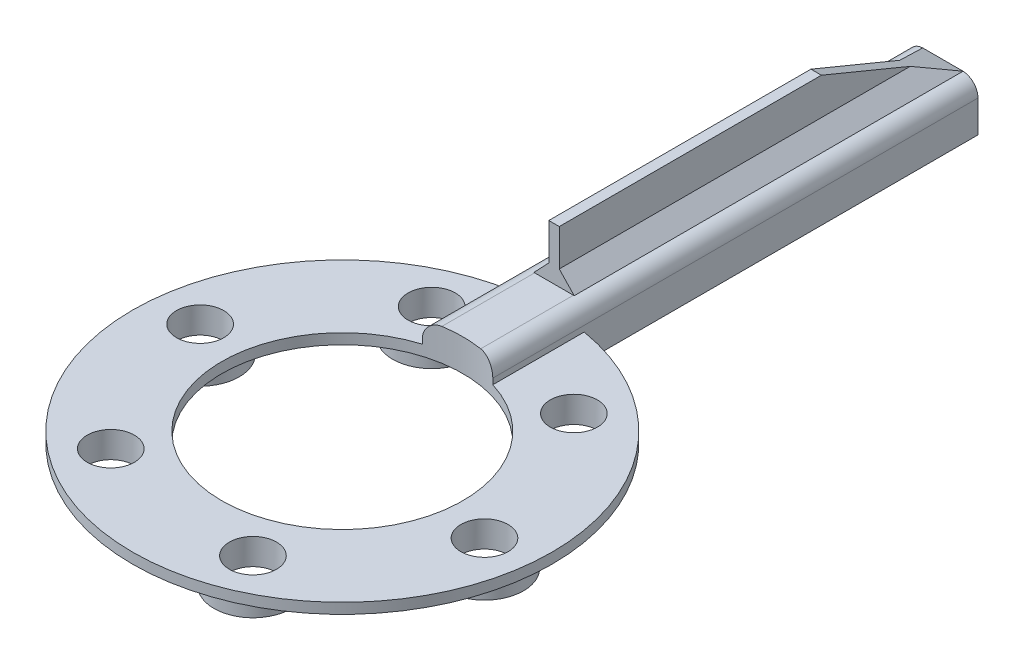
ISO-10303-21;
HEADER;
FILE_DESCRIPTION(('STEP AP214'),'2;1');
FILE_NAME('part.step','',(''),(''),'','','');
FILE_SCHEMA(('AUTOMOTIVE_DESIGN { 1 0 10303 214 1 1 1 1 }'));
ENDSEC;
DATA;
#1=APPLICATION_CONTEXT('core data for automotive mechanical design processes');
#2=APPLICATION_PROTOCOL_DEFINITION('international standard','automotive_design',2000,#1);
#3=PRODUCT_CONTEXT('',#1,'mechanical');
#4=PRODUCT('Part','Part','',(#3));
#5=PRODUCT_RELATED_PRODUCT_CATEGORY('part','',(#4));
#6=PRODUCT_DEFINITION_FORMATION('','',#4);
#7=PRODUCT_DEFINITION_CONTEXT('part definition',#1,'design');
#8=PRODUCT_DEFINITION('design','',#6,#7);
#9=PRODUCT_DEFINITION_SHAPE('','',#8);
#10=(LENGTH_UNIT() NAMED_UNIT(*) SI_UNIT(.MILLI.,.METRE.));
#11=(NAMED_UNIT(*) PLANE_ANGLE_UNIT() SI_UNIT($,.RADIAN.));
#12=(NAMED_UNIT(*) SI_UNIT($,.STERADIAN.) SOLID_ANGLE_UNIT());
#13=UNCERTAINTY_MEASURE_WITH_UNIT(LENGTH_MEASURE(1.E-05),#10,'distance_accuracy_value','');
#14=(GEOMETRIC_REPRESENTATION_CONTEXT(3) GLOBAL_UNCERTAINTY_ASSIGNED_CONTEXT((#13)) GLOBAL_UNIT_ASSIGNED_CONTEXT((#10,
#11,#12)) REPRESENTATION_CONTEXT('',''));
#15=CARTESIAN_POINT('',(0.,0.,0.));
#16=DIRECTION('',(0.,0.,1.));
#17=DIRECTION('',(1.,0.,0.));
#18=AXIS2_PLACEMENT_3D('',#15,#16,#17);
#19=CARTESIAN_POINT('',(0.,0.,0.));
#20=DIRECTION('',(0.,1.,0.));
#21=DIRECTION('',(0.,0.,1.));
#22=AXIS2_PLACEMENT_3D('',#19,#20,#21);
#23=PLANE('',#22);
#24=CARTESIAN_POINT('',(0.,0.,0.));
#25=DIRECTION('',(0.,1.,0.));
#26=DIRECTION('',(0.,0.,1.));
#27=AXIS2_PLACEMENT_3D('',#24,#25,#26);
#28=CIRCLE('',#27,23.);
#29=CARTESIAN_POINT('',(0.,0.,23.));
#30=VERTEX_POINT('',#29);
#31=EDGE_CURVE('E277',#30,#30,#28,.T.);
#32=ORIENTED_EDGE('',*,*,#31,.T.);
#33=EDGE_LOOP('',(#32));
#34=FACE_BOUND('',#33,.T.);
#35=CARTESIAN_POINT('',(-19.1759850137748,0.,24.9906302191738));
#36=DIRECTION('',(0.,1.,0.));
#37=DIRECTION('',(0.,0.,1.));
#38=AXIS2_PLACEMENT_3D('',#35,#36,#37);
#39=CIRCLE('',#38,7.44688392869642);
#40=CARTESIAN_POINT('',(-19.1759850137748,0.,32.4375141478702));
#41=VERTEX_POINT('',#40);
#42=EDGE_CURVE('E287',#41,#41,#39,.F.);
#43=ORIENTED_EDGE('',*,*,#42,.F.);
#44=EDGE_LOOP('',(#43));
#45=FACE_BOUND('',#44,.T.);
#46=CARTESIAN_POINT('',(12.0545281194995,0.,29.1022052741037));
#47=DIRECTION('',(0.,1.,0.));
#48=DIRECTION('',(0.,0.,1.));
#49=AXIS2_PLACEMENT_3D('',#46,#47,#48);
#50=CIRCLE('',#49,7.44688392869571);
#51=CARTESIAN_POINT('',(12.0545281194995,0.,36.5490892027994));
#52=VERTEX_POINT('',#51);
#53=EDGE_CURVE('E292',#52,#52,#50,.F.);
#54=ORIENTED_EDGE('',*,*,#53,.F.);
#55=EDGE_LOOP('',(#54));
#56=FACE_BOUND('',#55,.T.);
#57=CARTESIAN_POINT('',(31.2305131332723,0.,4.11157505492955));
#58=DIRECTION('',(0.,1.,0.));
#59=DIRECTION('',(0.,0.,1.));
#60=AXIS2_PLACEMENT_3D('',#57,#58,#59);
#61=CIRCLE('',#60,7.44688392869377);
#62=CARTESIAN_POINT('',(31.2305131332723,0.,11.5584589836233));
#63=VERTEX_POINT('',#62);
#64=EDGE_CURVE('E295',#63,#63,#61,.F.);
#65=ORIENTED_EDGE('',*,*,#64,.F.);
#66=EDGE_LOOP('',(#65));
#67=FACE_BOUND('',#66,.T.);
#68=CARTESIAN_POINT('',(19.1759850137709,0.,-24.9906302191745));
#69=DIRECTION('',(0.,1.,0.));
#70=DIRECTION('',(0.,0.,1.));
#71=AXIS2_PLACEMENT_3D('',#68,#69,#70);
#72=CIRCLE('',#71,7.44688392869261);
#73=CARTESIAN_POINT('',(19.1759850137709,0.,-17.5437462904819));
#74=VERTEX_POINT('',#73);
#75=EDGE_CURVE('E298',#74,#74,#72,.F.);
#76=ORIENTED_EDGE('',*,*,#75,.F.);
#77=EDGE_LOOP('',(#76));
#78=FACE_BOUND('',#77,.T.);
#79=CARTESIAN_POINT('',(-31.2305131332763,0.,-4.11157505493029));
#80=DIRECTION('',(0.,1.,0.));
#81=DIRECTION('',(0.,0.,1.));
#82=AXIS2_PLACEMENT_3D('',#79,#80,#81);
#83=CIRCLE('',#82,7.44688392869558);
#84=CARTESIAN_POINT('',(-31.2305131332763,0.,3.33530887376529));
#85=VERTEX_POINT('',#84);
#86=EDGE_CURVE('E304',#85,#85,#83,.F.);
#87=ORIENTED_EDGE('',*,*,#86,.F.);
#88=EDGE_LOOP('',(#87));
#89=FACE_BOUND('',#88,.T.);
#90=CARTESIAN_POINT('',(-12.0545281195034,0.,-29.1022052741044));
#91=DIRECTION('',(0.,1.,0.));
#92=DIRECTION('',(0.,0.,1.));
#93=AXIS2_PLACEMENT_3D('',#90,#91,#92);
#94=CIRCLE('',#93,7.44688392869349);
#95=CARTESIAN_POINT('',(-12.0545281195034,0.,-21.6553213454109));
#96=VERTEX_POINT('',#95);
#97=EDGE_CURVE('E301',#96,#96,#94,.F.);
#98=ORIENTED_EDGE('',*,*,#97,.F.);
#99=EDGE_LOOP('',(#98));
#100=FACE_BOUND('',#99,.T.);
#101=DIRECTION('',(-1.,0.,0.));
#102=VECTOR('',#101,1.);
#103=CARTESIAN_POINT('',(-6.7,0.,-39.4348830352012));
#104=LINE('',#103,#102);
#105=CARTESIAN_POINT('',(6.7,0.,-39.4348830352012));
#106=VERTEX_POINT('',#105);
#107=CARTESIAN_POINT('',(-6.7,0.,-39.4348830352012));
#108=VERTEX_POINT('',#107);
#109=EDGE_CURVE('E160',#106,#108,#104,.T.);
#110=ORIENTED_EDGE('',*,*,#109,.F.);
#111=CARTESIAN_POINT('',(0.,0.,0.));
#112=DIRECTION('',(0.,1.,0.));
#113=DIRECTION('',(0.,0.,1.));
#114=AXIS2_PLACEMENT_3D('',#111,#112,#113);
#115=CIRCLE('',#114,40.);
#116=EDGE_CURVE('E281',#108,#106,#115,.T.);
#117=ORIENTED_EDGE('',*,*,#116,.F.);
#118=EDGE_LOOP('',(#110,#117));
#119=FACE_BOUND('',#118,.T.);
#120=ADVANCED_FACE('F35',(#34,#45,#56,#67,#78,#89,#100,#119),#23,.F.);
#121=CARTESIAN_POINT('',(0.,6.1,0.));
#122=DIRECTION('',(0.,-1.,0.));
#123=DIRECTION('',(0.,0.,-1.));
#124=AXIS2_PLACEMENT_3D('',#121,#122,#123);
#125=PLANE('',#124);
#126=DIRECTION('',(-1.,0.,0.));
#127=VECTOR('',#126,1.);
#128=CARTESIAN_POINT('',(1.,6.1,-40.3829480565997));
#129=LINE('',#128,#127);
#130=CARTESIAN_POINT('',(3.7,6.1,-40.3829480565997));
#131=VERTEX_POINT('',#130);
#132=CARTESIAN_POINT('',(-3.7,6.1,-40.3829480565997));
#133=VERTEX_POINT('',#132);
#134=EDGE_CURVE('E59',#131,#133,#129,.T.);
#135=ORIENTED_EDGE('',*,*,#134,.T.);
#136=DIRECTION('',(0.,0.,-1.));
#137=VECTOR('',#136,1.);
#138=CARTESIAN_POINT('',(-3.7,6.1,-22.0024998579707));
#139=LINE('',#138,#137);
#140=CARTESIAN_POINT('',(-3.7,6.1,-22.7004405243599));
#141=VERTEX_POINT('',#140);
#142=EDGE_CURVE('E398',#133,#141,#139,.F.);
#143=ORIENTED_EDGE('',*,*,#142,.T.);
#144=CARTESIAN_POINT('',(0.,6.1,0.));
#145=DIRECTION('',(0.,1.,0.));
#146=DIRECTION('',(0.,0.,-1.));
#147=AXIS2_PLACEMENT_3D('',#144,#145,#146);
#148=CIRCLE('',#147,23.);
#149=CARTESIAN_POINT('',(3.7,6.1,-22.7004405243599));
#150=VERTEX_POINT('',#149);
#151=EDGE_CURVE('E221',#150,#141,#148,.T.);
#152=ORIENTED_EDGE('',*,*,#151,.F.);
#153=DIRECTION('',(0.,0.,1.));
#154=VECTOR('',#153,1.);
#155=CARTESIAN_POINT('',(3.7,6.1,-114.555494514846));
#156=LINE('',#155,#154);
#157=EDGE_CURVE('E396',#150,#131,#156,.F.);
#158=ORIENTED_EDGE('',*,*,#157,.T.);
#159=EDGE_LOOP('',(#135,#143,#152,#158));
#160=FACE_BOUND('',#159,.T.);
#161=ADVANCED_FACE('F354',(#160),#125,.F.);
#162=CARTESIAN_POINT('',(0.,2.,0.));
#163=DIRECTION('',(0.,1.,0.));
#164=DIRECTION('',(0.,0.,1.));
#165=AXIS2_PLACEMENT_3D('',#162,#163,#164);
#166=PLANE('',#165);
#167=CARTESIAN_POINT('',(31.2305131332737,2.,4.11157505492763));
#168=DIRECTION('',(0.,1.,0.));
#169=DIRECTION('',(0.,0.,1.));
#170=AXIS2_PLACEMENT_3D('',#167,#168,#169);
#171=CIRCLE('',#170,4.4999999999962);
#172=CARTESIAN_POINT('',(31.2305131332737,2.,8.61157505492383));
#173=VERTEX_POINT('',#172);
#174=EDGE_CURVE('E190',#173,#173,#171,.T.);
#175=ORIENTED_EDGE('',*,*,#174,.F.);
#176=EDGE_LOOP('',(#175));
#177=FACE_BOUND('',#176,.T.);
#178=CARTESIAN_POINT('',(12.054528119503,2.,29.1022052741024));
#179=DIRECTION('',(0.,1.,0.));
#180=DIRECTION('',(0.,0.,1.));
#181=AXIS2_PLACEMENT_3D('',#178,#179,#180);
#182=CIRCLE('',#181,4.4999999999962);
#183=CARTESIAN_POINT('',(12.054528119503,2.,33.6022052740986));
#184=VERTEX_POINT('',#183);
#185=EDGE_CURVE('E193',#184,#184,#182,.T.);
#186=ORIENTED_EDGE('',*,*,#185,.F.);
#187=EDGE_LOOP('',(#186));
#188=FACE_BOUND('',#187,.T.);
#189=CARTESIAN_POINT('',(-19.1759850137707,2.,24.9906302191746));
#190=DIRECTION('',(0.,1.,0.));
#191=DIRECTION('',(0.,0.,1.));
#192=AXIS2_PLACEMENT_3D('',#189,#190,#191);
#193=CIRCLE('',#192,4.4999999999962);
#194=CARTESIAN_POINT('',(-19.1759850137707,2.,29.4906302191708));
#195=VERTEX_POINT('',#194);
#196=EDGE_CURVE('E196',#195,#195,#193,.T.);
#197=ORIENTED_EDGE('',*,*,#196,.F.);
#198=EDGE_LOOP('',(#197));
#199=FACE_BOUND('',#198,.T.);
#200=CARTESIAN_POINT('',(-31.2305131332737,2.,-4.11157505492787));
#201=DIRECTION('',(0.,1.,0.));
#202=DIRECTION('',(0.,0.,1.));
#203=AXIS2_PLACEMENT_3D('',#200,#201,#202);
#204=CIRCLE('',#203,4.4999999999962);
#205=CARTESIAN_POINT('',(-31.2305131332737,2.,0.388424945068334));
#206=VERTEX_POINT('',#205);
#207=EDGE_CURVE('E175',#206,#206,#204,.T.);
#208=ORIENTED_EDGE('',*,*,#207,.F.);
#209=EDGE_LOOP('',(#208));
#210=FACE_BOUND('',#209,.T.);
#211=CARTESIAN_POINT('',(-12.0545281195028,2.,-29.1022052741025));
#212=DIRECTION('',(0.,1.,0.));
#213=DIRECTION('',(0.,0.,1.));
#214=AXIS2_PLACEMENT_3D('',#211,#212,#213);
#215=CIRCLE('',#214,4.49999999999619);
#216=CARTESIAN_POINT('',(-12.0545281195028,2.,-24.6022052741063));
#217=VERTEX_POINT('',#216);
#218=EDGE_CURVE('E178',#217,#217,#215,.T.);
#219=ORIENTED_EDGE('',*,*,#218,.F.);
#220=EDGE_LOOP('',(#219));
#221=FACE_BOUND('',#220,.T.);
#222=CARTESIAN_POINT('',(19.1759850137709,2.,-24.9906302191745));
#223=DIRECTION('',(0.,1.,0.));
#224=DIRECTION('',(0.,0.,1.));
#225=AXIS2_PLACEMENT_3D('',#222,#223,#224);
#226=CIRCLE('',#225,4.4999999999962);
#227=CARTESIAN_POINT('',(19.1759850137709,2.,-20.4906302191783));
#228=VERTEX_POINT('',#227);
#229=EDGE_CURVE('E187',#228,#228,#226,.T.);
#230=ORIENTED_EDGE('',*,*,#229,.F.);
#231=EDGE_LOOP('',(#230));
#232=FACE_BOUND('',#231,.T.);
#233=DIRECTION('',(0.,0.,-1.));
#234=VECTOR('',#233,1.);
#235=CARTESIAN_POINT('',(6.7,2.,0.));
#236=LINE('',#235,#234);
#237=CARTESIAN_POINT('',(6.7,2.,-22.0024998579707));
#238=VERTEX_POINT('',#237);
#239=CARTESIAN_POINT('',(6.7,2.,-39.4348830352012));
#240=VERTEX_POINT('',#239);
#241=EDGE_CURVE('E239',#238,#240,#236,.T.);
#242=ORIENTED_EDGE('',*,*,#241,.F.);
#243=CARTESIAN_POINT('',(0.,2.,0.));
#244=DIRECTION('',(0.,1.,0.));
#245=DIRECTION('',(0.,0.,1.));
#246=AXIS2_PLACEMENT_3D('',#243,#244,#245);
#247=CIRCLE('',#246,23.);
#248=CARTESIAN_POINT('',(-6.7,2.,-22.0024998579707));
#249=VERTEX_POINT('',#248);
#250=EDGE_CURVE('E278',#249,#238,#247,.T.);
#251=ORIENTED_EDGE('',*,*,#250,.F.);
#252=DIRECTION('',(0.,0.,1.));
#253=VECTOR('',#252,1.);
#254=CARTESIAN_POINT('',(-6.7,2.,0.));
#255=LINE('',#254,#253);
#256=CARTESIAN_POINT('',(-6.7,2.,-39.4348830352012));
#257=VERTEX_POINT('',#256);
#258=EDGE_CURVE('E235',#257,#249,#255,.T.);
#259=ORIENTED_EDGE('',*,*,#258,.F.);
#260=CARTESIAN_POINT('',(0.,2.,0.));
#261=DIRECTION('',(0.,1.,0.));
#262=DIRECTION('',(0.,0.,1.));
#263=AXIS2_PLACEMENT_3D('',#260,#261,#262);
#264=CIRCLE('',#263,40.);
#265=EDGE_CURVE('E284',#257,#240,#264,.T.);
#266=ORIENTED_EDGE('',*,*,#265,.T.);
#267=EDGE_LOOP('',(#242,#251,#259,#266));
#268=FACE_BOUND('',#267,.T.);
#269=ADVANCED_FACE('F362',(#177,#188,#199,#210,#221,#232,#268),#166,.T.);
#270=CARTESIAN_POINT('',(0.,2.,0.));
#271=DIRECTION('',(0.,-1.,0.));
#272=DIRECTION('',(0.,0.,-1.));
#273=AXIS2_PLACEMENT_3D('',#270,#271,#272);
#274=CYLINDRICAL_SURFACE('',#273,40.);
#275=ORIENTED_EDGE('',*,*,#116,.T.);
#276=DIRECTION('',(0.,-1.,0.));
#277=VECTOR('',#276,1.);
#278=CARTESIAN_POINT('',(6.7,2.,-39.4348830352012));
#279=LINE('',#278,#277);
#280=EDGE_CURVE('E157',#106,#240,#279,.F.);
#281=ORIENTED_EDGE('',*,*,#280,.T.);
#282=ORIENTED_EDGE('',*,*,#265,.F.);
#283=DIRECTION('',(0.,-1.,0.));
#284=VECTOR('',#283,1.);
#285=CARTESIAN_POINT('',(-6.7,2.,-39.4348830352012));
#286=LINE('',#285,#284);
#287=EDGE_CURVE('E227',#257,#108,#286,.T.);
#288=ORIENTED_EDGE('',*,*,#287,.T.);
#289=EDGE_LOOP('',(#275,#281,#282,#288));
#290=FACE_BOUND('',#289,.T.);
#291=ADVANCED_FACE('F365',(#290),#274,.T.);
#292=CARTESIAN_POINT('',(0.,2.,0.));
#293=DIRECTION('',(0.,-1.,0.));
#294=DIRECTION('',(0.,0.,-1.));
#295=AXIS2_PLACEMENT_3D('',#292,#293,#294);
#296=CYLINDRICAL_SURFACE('',#295,23.);
#297=DIRECTION('',(0.,-1.,0.));
#298=VECTOR('',#297,1.);
#299=CARTESIAN_POINT('',(6.7,6.1,-22.0024998579707));
#300=LINE('',#299,#298);
#301=CARTESIAN_POINT('',(6.7,3.1,-22.0024998579707));
#302=VERTEX_POINT('',#301);
#303=EDGE_CURVE('E225',#302,#238,#300,.T.);
#304=ORIENTED_EDGE('',*,*,#303,.F.);
#305=CARTESIAN_POINT('',(6.7,3.1,-22.0024998579707));
#306=CARTESIAN_POINT('',(6.70001003964245,3.1820756339502,-22.0024932830175));
#307=CARTESIAN_POINT('',(6.69663195831681,3.26414565895637,-22.0035253747335));
#308=CARTESIAN_POINT('',(6.68317716733815,3.42767018688449,-22.0076176207985));
#309=CARTESIAN_POINT('',(6.67310160607981,3.50912479290908,-22.0106774274616));
#310=CARTESIAN_POINT('',(6.64635915902038,3.670663081425,-22.018766868073));
#311=CARTESIAN_POINT('',(6.62970696663409,3.75074940760118,-22.0237921106316));
#312=CARTESIAN_POINT('',(6.58997533086844,3.90914714914094,-22.0357131062568));
#313=CARTESIAN_POINT('',(6.56689580327635,3.98745854123432,-22.0426088838316));
#314=CARTESIAN_POINT('',(6.48828875729732,4.21889467098213,-22.06592706045));
#315=CARTESIAN_POINT('',(6.42336520097991,4.3686861333681,-22.0849888818757));
#316=CARTESIAN_POINT('',(6.2706190754616,4.65509333963245,-22.1288411169506));
#317=CARTESIAN_POINT('',(6.18278983446469,4.79170522875514,-22.1536331994273));
#318=CARTESIAN_POINT('',(5.98451136607127,5.05148737676125,-22.2080257620708));
#319=CARTESIAN_POINT('',(5.87358715661877,5.17427495246144,-22.2377239540906));
#320=CARTESIAN_POINT('',(5.63349396455553,5.39972603910985,-22.2997555893287));
#321=CARTESIAN_POINT('',(5.50431935649475,5.50238332176933,-22.3320898437745));
#322=CARTESIAN_POINT('',(5.22620267787313,5.68837386461401,-22.3988381592018));
#323=CARTESIAN_POINT('',(5.07671976492916,5.77088698825457,-22.4332852644446));
#324=CARTESIAN_POINT('',(4.76582678257681,5.90943840264312,-22.5013815037979));
#325=CARTESIAN_POINT('',(4.60442278535205,5.96549006584146,-22.5350310327844));
#326=CARTESIAN_POINT('',(4.31882920051879,6.03811382707345,-22.5912102418696));
#327=CARTESIAN_POINT('',(4.1963791418278,6.0612631120454,-22.6142862542486));
#328=CARTESIAN_POINT('',(3.94936511718303,6.09221196184408,-22.6587393803229));
#329=CARTESIAN_POINT('',(3.82480306325593,6.10002473337448,-22.6801179405037));
#330=CARTESIAN_POINT('',(3.7,6.1,-22.7004405243599));
#331=B_SPLINE_CURVE_WITH_KNOTS('',3,(#305,#306,#307,#308,#309,#310,#311,#312,#313,#314,#315,
#316,#317,#318,#319,#320,#321,#322,#323,#324,#325,#326,#327,#328,#329,#330),.UNSPECIFIED.,.F.,
.F.,(4,2,2,2,2,2,2,2,2,2,2,2,4),(0.,0.246141258349117,0.492240322556072,0.737792638240607,
0.98334817137151,1.47396371040604,1.96472231216666,2.46679964576113,2.96903207722855,
3.48918352667281,4.00907183247682,4.38837128580338,4.76734397015466),.UNSPECIFIED.);
#332=EDGE_CURVE('E318',#302,#150,#331,.T.);
#333=ORIENTED_EDGE('',*,*,#332,.T.);
#334=ORIENTED_EDGE('',*,*,#151,.T.);
#335=CARTESIAN_POINT('',(-3.7,6.1,-22.7004405243599));
#336=CARTESIAN_POINT('',(-3.78596573875815,6.10000771180815,-22.6864336129908));
#337=CARTESIAN_POINT('',(-3.87184271892009,6.0963050737171,-22.6719302799195));
#338=CARTESIAN_POINT('',(-4.04280478770478,6.08158234138237,-22.6420670593447));
#339=CARTESIAN_POINT('',(-4.12788998941634,6.07056330891677,-22.6267072964252));
#340=CARTESIAN_POINT('',(-4.29658841494405,6.04132674640746,-22.595280316505));
#341=CARTESIAN_POINT('',(-4.38020312712809,6.02311699168197,-22.5792138802489));
#342=CARTESIAN_POINT('',(-4.5454531763581,5.97967309964248,-22.5465288787648));
#343=CARTESIAN_POINT('',(-4.62708847968947,5.95443884277374,-22.5299103041438));
#344=CARTESIAN_POINT('',(-4.86819014747698,5.86846253568838,-22.4794920001263));
#345=CARTESIAN_POINT('',(-5.0240007669344,5.79742097984316,-22.4451017885123));
#346=CARTESIAN_POINT('',(-5.32126364750641,5.62995097335448,-22.3764946165815));
#347=CARTESIAN_POINT('',(-5.46271496428508,5.53352085453527,-22.3422776677997));
#348=CARTESIAN_POINT('',(-5.72855094843419,5.31688819178954,-22.2756062859441));
#349=CARTESIAN_POINT('',(-5.85279188829257,5.19650377975954,-22.2431679209357));
#350=CARTESIAN_POINT('',(-6.07919057121004,4.93556119754361,-22.1823629663145));
#351=CARTESIAN_POINT('',(-6.18134624360402,4.79500113778819,-22.1539967585817));
#352=CARTESIAN_POINT('',(-6.35875759865255,4.50004983690629,-22.1037234381833));
#353=CARTESIAN_POINT('',(-6.43443437951958,4.34592906018068,-22.081716285539));
#354=CARTESIAN_POINT('',(-6.55853385138325,4.02632933189761,-22.0451777411805));
#355=CARTESIAN_POINT('',(-6.60698739378522,3.86086347711262,-22.0306378885773));
#356=CARTESIAN_POINT('',(-6.6605589466047,3.59496851264124,-22.0144806154922));
#357=CARTESIAN_POINT('',(-6.67533566035178,3.49655795267843,-22.0099992679052));
#358=CARTESIAN_POINT('',(-6.69505540546189,3.29878272166909,-22.0040058089276));
#359=CARTESIAN_POINT('',(-6.70000976624914,3.19941928284619,-22.0024902766944));
#360=CARTESIAN_POINT('',(-6.7,3.1,-22.0024998579707));
#361=B_SPLINE_CURVE_WITH_KNOTS('',3,(#335,#336,#337,#338,#339,#340,#341,#342,#343,#344,#345,
#346,#347,#348,#349,#350,#351,#352,#353,#354,#355,#356,#357,#358,#359,#360),.UNSPECIFIED.,.F.,
.F.,(4,2,2,2,2,2,2,2,2,2,2,2,4),(0.,0.261205375214357,0.522372851769385,0.783258698195203,
1.04414898508448,1.56547536602316,2.08683600967883,2.61231737432581,3.1378479855805,
3.65459421208376,4.17075363583142,4.46911291211333,4.76712785033517),.UNSPECIFIED.);
#362=CARTESIAN_POINT('',(-6.7,3.1,-22.0024998579707));
#363=VERTEX_POINT('',#362);
#364=EDGE_CURVE('E310',#141,#363,#361,.T.);
#365=ORIENTED_EDGE('',*,*,#364,.T.);
#366=DIRECTION('',(0.,-1.,0.));
#367=VECTOR('',#366,1.);
#368=CARTESIAN_POINT('',(-6.7,6.1,-22.0024998579707));
#369=LINE('',#368,#367);
#370=EDGE_CURVE('E224',#363,#249,#369,.T.);
#371=ORIENTED_EDGE('',*,*,#370,.T.);
#372=ORIENTED_EDGE('',*,*,#250,.T.);
#373=EDGE_LOOP('',(#304,#333,#334,#365,#371,#372));
#374=FACE_BOUND('',#373,.T.);
#375=ORIENTED_EDGE('',*,*,#31,.F.);
#376=EDGE_LOOP('',(#375));
#377=FACE_BOUND('',#376,.T.);
#378=ADVANCED_FACE('F325',(#374,#377),#296,.F.);
#379=CARTESIAN_POINT('',(-19.1759850137748,-3.,24.9906302191738));
#380=DIRECTION('',(0.,-1.,0.));
#381=DIRECTION('',(0.,0.,-1.));
#382=AXIS2_PLACEMENT_3D('',#379,#380,#381);
#383=PLANE('',#382);
#384=CARTESIAN_POINT('',(-19.1759850137748,-3.,24.9906302191738));
#385=DIRECTION('',(0.,-1.,0.));
#386=DIRECTION('',(0.,0.,-1.));
#387=AXIS2_PLACEMENT_3D('',#384,#385,#386);
#388=CIRCLE('',#387,7.44688392869642);
#389=CARTESIAN_POINT('',(-19.1759850137748,-3.,17.5437462904774));
#390=VERTEX_POINT('',#389);
#391=EDGE_CURVE('E274',#390,#390,#388,.T.);
#392=ORIENTED_EDGE('',*,*,#391,.T.);
#393=EDGE_LOOP('',(#392));
#394=FACE_BOUND('',#393,.T.);
#395=CARTESIAN_POINT('',(-19.1759850137748,-3.,24.9906302191738));
#396=DIRECTION('',(0.,-1.,0.));
#397=DIRECTION('',(0.,0.,-1.));
#398=AXIS2_PLACEMENT_3D('',#395,#396,#397);
#399=CIRCLE('',#398,4.5);
#400=CARTESIAN_POINT('',(-19.1759850137748,-3.,20.4906302191738));
#401=VERTEX_POINT('',#400);
#402=EDGE_CURVE('E271',#401,#401,#399,.T.);
#403=ORIENTED_EDGE('',*,*,#402,.F.);
#404=EDGE_LOOP('',(#403));
#405=FACE_BOUND('',#404,.T.);
#406=ADVANCED_FACE('F371',(#394,#405),#383,.T.);
#407=CARTESIAN_POINT('',(-19.1759850137748,-3.,24.9906302191738));
#408=DIRECTION('',(0.,1.,0.));
#409=DIRECTION('',(0.,0.,1.));
#410=AXIS2_PLACEMENT_3D('',#407,#408,#409);
#411=CYLINDRICAL_SURFACE('',#410,7.44688392869642);
#412=ORIENTED_EDGE('',*,*,#391,.F.);
#413=EDGE_LOOP('',(#412));
#414=FACE_BOUND('',#413,.T.);
#415=ORIENTED_EDGE('',*,*,#42,.T.);
#416=EDGE_LOOP('',(#415));
#417=FACE_BOUND('',#416,.T.);
#418=ADVANCED_FACE('F532',(#414,#417),#411,.T.);
#419=CARTESIAN_POINT('',(-19.1759850137748,-3.,24.9906302191738));
#420=DIRECTION('',(0.,1.,0.));
#421=DIRECTION('',(0.,0.,1.));
#422=AXIS2_PLACEMENT_3D('',#419,#420,#421);
#423=CYLINDRICAL_SURFACE('',#422,4.5);
#424=ORIENTED_EDGE('',*,*,#402,.T.);
#425=EDGE_LOOP('',(#424));
#426=FACE_BOUND('',#425,.T.);
#427=ORIENTED_EDGE('',*,*,#196,.T.);
#428=EDGE_LOOP('',(#427));
#429=FACE_BOUND('',#428,.T.);
#430=ADVANCED_FACE('F525',(#426,#429),#423,.F.);
#431=CARTESIAN_POINT('',(12.0545281194995,-3.,29.1022052741037));
#432=DIRECTION('',(0.,-1.,0.));
#433=DIRECTION('',(0.,0.,-1.));
#434=AXIS2_PLACEMENT_3D('',#431,#432,#433);
#435=PLANE('',#434);
#436=CARTESIAN_POINT('',(12.0545281194995,-3.,29.1022052741037));
#437=DIRECTION('',(0.,-1.,0.));
#438=DIRECTION('',(0.,0.,-1.));
#439=AXIS2_PLACEMENT_3D('',#436,#437,#438);
#440=CIRCLE('',#439,7.44688392869571);
#441=CARTESIAN_POINT('',(12.0545281194995,-3.,21.655321345408));
#442=VERTEX_POINT('',#441);
#443=EDGE_CURVE('E268',#442,#442,#440,.T.);
#444=ORIENTED_EDGE('',*,*,#443,.T.);
#445=EDGE_LOOP('',(#444));
#446=FACE_BOUND('',#445,.T.);
#447=CARTESIAN_POINT('',(12.0545281194995,-3.,29.1022052741037));
#448=DIRECTION('',(0.,-1.,0.));
#449=DIRECTION('',(0.,0.,-1.));
#450=AXIS2_PLACEMENT_3D('',#447,#448,#449);
#451=CIRCLE('',#450,4.49999999999929);
#452=CARTESIAN_POINT('',(12.0545281194995,-3.,24.6022052741044));
#453=VERTEX_POINT('',#452);
#454=EDGE_CURVE('E265',#453,#453,#451,.T.);
#455=ORIENTED_EDGE('',*,*,#454,.F.);
#456=EDGE_LOOP('',(#455));
#457=FACE_BOUND('',#456,.T.);
#458=ADVANCED_FACE('F522',(#446,#457),#435,.T.);
#459=CARTESIAN_POINT('',(12.0545281194995,-3.,29.1022052741037));
#460=DIRECTION('',(0.,1.,0.));
#461=DIRECTION('',(0.,0.,1.));
#462=AXIS2_PLACEMENT_3D('',#459,#460,#461);
#463=CYLINDRICAL_SURFACE('',#462,7.44688392869571);
#464=ORIENTED_EDGE('',*,*,#443,.F.);
#465=EDGE_LOOP('',(#464));
#466=FACE_BOUND('',#465,.T.);
#467=ORIENTED_EDGE('',*,*,#53,.T.);
#468=EDGE_LOOP('',(#467));
#469=FACE_BOUND('',#468,.T.);
#470=ADVANCED_FACE('F520',(#466,#469),#463,.T.);
#471=CARTESIAN_POINT('',(12.0545281194995,-3.,29.1022052741037));
#472=DIRECTION('',(0.,1.,0.));
#473=DIRECTION('',(0.,0.,1.));
#474=AXIS2_PLACEMENT_3D('',#471,#472,#473);
#475=CYLINDRICAL_SURFACE('',#474,4.49999999999929);
#476=ORIENTED_EDGE('',*,*,#454,.T.);
#477=EDGE_LOOP('',(#476));
#478=FACE_BOUND('',#477,.T.);
#479=ORIENTED_EDGE('',*,*,#185,.T.);
#480=EDGE_LOOP('',(#479));
#481=FACE_BOUND('',#480,.T.);
#482=ADVANCED_FACE('F513',(#478,#481),#475,.F.);
#483=CARTESIAN_POINT('',(31.2305131332723,-3.,4.11157505492955));
#484=DIRECTION('',(0.,-1.,0.));
#485=DIRECTION('',(0.,0.,-1.));
#486=AXIS2_PLACEMENT_3D('',#483,#484,#485);
#487=PLANE('',#486);
#488=CARTESIAN_POINT('',(31.2305131332723,-3.,4.11157505492955));
#489=DIRECTION('',(0.,-1.,0.));
#490=DIRECTION('',(0.,0.,-1.));
#491=AXIS2_PLACEMENT_3D('',#488,#489,#490);
#492=CIRCLE('',#491,7.44688392869377);
#493=CARTESIAN_POINT('',(31.2305131332723,-3.,-3.33530887376421));
#494=VERTEX_POINT('',#493);
#495=EDGE_CURVE('E262',#494,#494,#492,.T.);
#496=ORIENTED_EDGE('',*,*,#495,.T.);
#497=EDGE_LOOP('',(#496));
#498=FACE_BOUND('',#497,.T.);
#499=CARTESIAN_POINT('',(31.2305131332723,-3.,4.11157505492955));
#500=DIRECTION('',(0.,-1.,0.));
#501=DIRECTION('',(0.,0.,-1.));
#502=AXIS2_PLACEMENT_3D('',#499,#500,#501);
#503=CIRCLE('',#502,4.49999999999735);
#504=CARTESIAN_POINT('',(31.2305131332723,-3.,-0.388424945067796));
#505=VERTEX_POINT('',#504);
#506=EDGE_CURVE('E259',#505,#505,#503,.T.);
#507=ORIENTED_EDGE('',*,*,#506,.F.);
#508=EDGE_LOOP('',(#507));
#509=FACE_BOUND('',#508,.T.);
#510=ADVANCED_FACE('F510',(#498,#509),#487,.T.);
#511=CARTESIAN_POINT('',(31.2305131332723,-3.,4.11157505492955));
#512=DIRECTION('',(0.,1.,0.));
#513=DIRECTION('',(0.,0.,1.));
#514=AXIS2_PLACEMENT_3D('',#511,#512,#513);
#515=CYLINDRICAL_SURFACE('',#514,7.44688392869377);
#516=ORIENTED_EDGE('',*,*,#495,.F.);
#517=EDGE_LOOP('',(#516));
#518=FACE_BOUND('',#517,.T.);
#519=ORIENTED_EDGE('',*,*,#64,.T.);
#520=EDGE_LOOP('',(#519));
#521=FACE_BOUND('',#520,.T.);
#522=ADVANCED_FACE('F508',(#518,#521),#515,.T.);
#523=CARTESIAN_POINT('',(31.2305131332723,-3.,4.11157505492955));
#524=DIRECTION('',(0.,1.,0.));
#525=DIRECTION('',(0.,0.,1.));
#526=AXIS2_PLACEMENT_3D('',#523,#524,#525);
#527=CYLINDRICAL_SURFACE('',#526,4.49999999999735);
#528=ORIENTED_EDGE('',*,*,#506,.T.);
#529=EDGE_LOOP('',(#528));
#530=FACE_BOUND('',#529,.T.);
#531=ORIENTED_EDGE('',*,*,#174,.T.);
#532=EDGE_LOOP('',(#531));
#533=FACE_BOUND('',#532,.T.);
#534=ADVANCED_FACE('F501',(#530,#533),#527,.F.);
#535=CARTESIAN_POINT('',(19.1759850137709,-3.,-24.9906302191745));
#536=DIRECTION('',(0.,-1.,0.));
#537=DIRECTION('',(0.,0.,-1.));
#538=AXIS2_PLACEMENT_3D('',#535,#536,#537);
#539=PLANE('',#538);
#540=CARTESIAN_POINT('',(19.1759850137709,-3.,-24.9906302191745));
#541=DIRECTION('',(0.,-1.,0.));
#542=DIRECTION('',(0.,0.,-1.));
#543=AXIS2_PLACEMENT_3D('',#540,#541,#542);
#544=CIRCLE('',#543,7.44688392869261);
#545=CARTESIAN_POINT('',(19.1759850137709,-3.,-32.4375141478671));
#546=VERTEX_POINT('',#545);
#547=EDGE_CURVE('E256',#546,#546,#544,.T.);
#548=ORIENTED_EDGE('',*,*,#547,.T.);
#549=EDGE_LOOP('',(#548));
#550=FACE_BOUND('',#549,.T.);
#551=CARTESIAN_POINT('',(19.1759850137709,-3.,-24.9906302191745));
#552=DIRECTION('',(0.,-1.,0.));
#553=DIRECTION('',(0.,0.,-1.));
#554=AXIS2_PLACEMENT_3D('',#551,#552,#553);
#555=CIRCLE('',#554,4.4999999999962);
#556=CARTESIAN_POINT('',(19.1759850137709,-3.,-29.4906302191707));
#557=VERTEX_POINT('',#556);
#558=EDGE_CURVE('E253',#557,#557,#555,.T.);
#559=ORIENTED_EDGE('',*,*,#558,.F.);
#560=EDGE_LOOP('',(#559));
#561=FACE_BOUND('',#560,.T.);
#562=ADVANCED_FACE('F498',(#550,#561),#539,.T.);
#563=CARTESIAN_POINT('',(19.1759850137709,-3.,-24.9906302191745));
#564=DIRECTION('',(0.,1.,0.));
#565=DIRECTION('',(0.,0.,1.));
#566=AXIS2_PLACEMENT_3D('',#563,#564,#565);
#567=CYLINDRICAL_SURFACE('',#566,7.44688392869261);
#568=ORIENTED_EDGE('',*,*,#547,.F.);
#569=EDGE_LOOP('',(#568));
#570=FACE_BOUND('',#569,.T.);
#571=ORIENTED_EDGE('',*,*,#75,.T.);
#572=EDGE_LOOP('',(#571));
#573=FACE_BOUND('',#572,.T.);
#574=ADVANCED_FACE('F496',(#570,#573),#567,.T.);
#575=CARTESIAN_POINT('',(19.1759850137709,-3.,-24.9906302191745));
#576=DIRECTION('',(0.,1.,0.));
#577=DIRECTION('',(0.,0.,1.));
#578=AXIS2_PLACEMENT_3D('',#575,#576,#577);
#579=CYLINDRICAL_SURFACE('',#578,4.4999999999962);
#580=ORIENTED_EDGE('',*,*,#558,.T.);
#581=EDGE_LOOP('',(#580));
#582=FACE_BOUND('',#581,.T.);
#583=ORIENTED_EDGE('',*,*,#229,.T.);
#584=EDGE_LOOP('',(#583));
#585=FACE_BOUND('',#584,.T.);
#586=ADVANCED_FACE('F489',(#582,#585),#579,.F.);
#587=CARTESIAN_POINT('',(-12.0545281195034,-3.,-29.1022052741044));
#588=DIRECTION('',(0.,-1.,0.));
#589=DIRECTION('',(0.,0.,-1.));
#590=AXIS2_PLACEMENT_3D('',#587,#588,#589);
#591=PLANE('',#590);
#592=CARTESIAN_POINT('',(-12.0545281195034,-3.,-29.1022052741044));
#593=DIRECTION('',(0.,-1.,0.));
#594=DIRECTION('',(0.,0.,-1.));
#595=AXIS2_PLACEMENT_3D('',#592,#593,#594);
#596=CIRCLE('',#595,7.44688392869349);
#597=CARTESIAN_POINT('',(-12.0545281195034,-3.,-36.5490892027979));
#598=VERTEX_POINT('',#597);
#599=EDGE_CURVE('E250',#598,#598,#596,.T.);
#600=ORIENTED_EDGE('',*,*,#599,.T.);
#601=EDGE_LOOP('',(#600));
#602=FACE_BOUND('',#601,.T.);
#603=CARTESIAN_POINT('',(-12.0545281195034,-3.,-29.1022052741044));
#604=DIRECTION('',(0.,-1.,0.));
#605=DIRECTION('',(0.,0.,-1.));
#606=AXIS2_PLACEMENT_3D('',#603,#604,#605);
#607=CIRCLE('',#606,4.49999999999707);
#608=CARTESIAN_POINT('',(-12.0545281195034,-3.,-33.6022052741015));
#609=VERTEX_POINT('',#608);
#610=EDGE_CURVE('E247',#609,#609,#607,.T.);
#611=ORIENTED_EDGE('',*,*,#610,.F.);
#612=EDGE_LOOP('',(#611));
#613=FACE_BOUND('',#612,.T.);
#614=ADVANCED_FACE('F486',(#602,#613),#591,.T.);
#615=CARTESIAN_POINT('',(-12.0545281195034,-3.,-29.1022052741044));
#616=DIRECTION('',(0.,1.,0.));
#617=DIRECTION('',(0.,0.,1.));
#618=AXIS2_PLACEMENT_3D('',#615,#616,#617);
#619=CYLINDRICAL_SURFACE('',#618,7.44688392869349);
#620=ORIENTED_EDGE('',*,*,#599,.F.);
#621=EDGE_LOOP('',(#620));
#622=FACE_BOUND('',#621,.T.);
#623=ORIENTED_EDGE('',*,*,#97,.T.);
#624=EDGE_LOOP('',(#623));
#625=FACE_BOUND('',#624,.T.);
#626=ADVANCED_FACE('F484',(#622,#625),#619,.T.);
#627=CARTESIAN_POINT('',(-12.0545281195034,-3.,-29.1022052741044));
#628=DIRECTION('',(0.,1.,0.));
#629=DIRECTION('',(0.,0.,1.));
#630=AXIS2_PLACEMENT_3D('',#627,#628,#629);
#631=CYLINDRICAL_SURFACE('',#630,4.49999999999707);
#632=ORIENTED_EDGE('',*,*,#610,.T.);
#633=EDGE_LOOP('',(#632));
#634=FACE_BOUND('',#633,.T.);
#635=ORIENTED_EDGE('',*,*,#218,.T.);
#636=EDGE_LOOP('',(#635));
#637=FACE_BOUND('',#636,.T.);
#638=ADVANCED_FACE('F477',(#634,#637),#631,.F.);
#639=CARTESIAN_POINT('',(-31.2305131332763,-3.,-4.11157505493029));
#640=DIRECTION('',(0.,-1.,0.));
#641=DIRECTION('',(0.,0.,-1.));
#642=AXIS2_PLACEMENT_3D('',#639,#640,#641);
#643=PLANE('',#642);
#644=CARTESIAN_POINT('',(-31.2305131332763,-3.,-4.11157505493029));
#645=DIRECTION('',(0.,-1.,0.));
#646=DIRECTION('',(0.,0.,-1.));
#647=AXIS2_PLACEMENT_3D('',#644,#645,#646);
#648=CIRCLE('',#647,7.44688392869558);
#649=CARTESIAN_POINT('',(-31.2305131332763,-3.,-11.5584589836259));
#650=VERTEX_POINT('',#649);
#651=EDGE_CURVE('E244',#650,#650,#648,.T.);
#652=ORIENTED_EDGE('',*,*,#651,.T.);
#653=EDGE_LOOP('',(#652));
#654=FACE_BOUND('',#653,.T.);
#655=CARTESIAN_POINT('',(-31.2305131332763,-3.,-4.11157505493029));
#656=DIRECTION('',(0.,-1.,0.));
#657=DIRECTION('',(0.,0.,-1.));
#658=AXIS2_PLACEMENT_3D('',#655,#656,#657);
#659=CIRCLE('',#658,4.49999999999916);
#660=CARTESIAN_POINT('',(-31.2305131332763,-3.,-8.61157505492945));
#661=VERTEX_POINT('',#660);
#662=EDGE_CURVE('E241',#661,#661,#659,.T.);
#663=ORIENTED_EDGE('',*,*,#662,.F.);
#664=EDGE_LOOP('',(#663));
#665=FACE_BOUND('',#664,.T.);
#666=ADVANCED_FACE('F474',(#654,#665),#643,.T.);
#667=CARTESIAN_POINT('',(-31.2305131332763,-3.,-4.11157505493029));
#668=DIRECTION('',(0.,1.,0.));
#669=DIRECTION('',(0.,0.,1.));
#670=AXIS2_PLACEMENT_3D('',#667,#668,#669);
#671=CYLINDRICAL_SURFACE('',#670,7.44688392869558);
#672=ORIENTED_EDGE('',*,*,#651,.F.);
#673=EDGE_LOOP('',(#672));
#674=FACE_BOUND('',#673,.T.);
#675=ORIENTED_EDGE('',*,*,#86,.T.);
#676=EDGE_LOOP('',(#675));
#677=FACE_BOUND('',#676,.T.);
#678=ADVANCED_FACE('F472',(#674,#677),#671,.T.);
#679=CARTESIAN_POINT('',(-31.2305131332763,-3.,-4.11157505493029));
#680=DIRECTION('',(0.,1.,0.));
#681=DIRECTION('',(0.,0.,1.));
#682=AXIS2_PLACEMENT_3D('',#679,#680,#681);
#683=CYLINDRICAL_SURFACE('',#682,4.49999999999916);
#684=ORIENTED_EDGE('',*,*,#662,.T.);
#685=EDGE_LOOP('',(#684));
#686=FACE_BOUND('',#685,.T.);
#687=ORIENTED_EDGE('',*,*,#207,.T.);
#688=EDGE_LOOP('',(#687));
#689=FACE_BOUND('',#688,.T.);
#690=ADVANCED_FACE('F465',(#686,#689),#683,.F.);
#691=CARTESIAN_POINT('',(6.7,6.1,-37.5015605745454));
#692=DIRECTION('',(1.,0.,0.));
#693=DIRECTION('',(0.,0.,-1.));
#694=AXIS2_PLACEMENT_3D('',#691,#692,#693);
#695=PLANE('',#694);
#696=DIRECTION('',(0.,-1.,0.));
#697=VECTOR('',#696,1.);
#698=CARTESIAN_POINT('',(6.7,6.1,-114.555494514846));
#699=LINE('',#698,#697);
#700=CARTESIAN_POINT('',(6.7,3.1,-114.555494514846));
#701=VERTEX_POINT('',#700);
#702=CARTESIAN_POINT('',(6.7,-3.,-114.555494514846));
#703=VERTEX_POINT('',#702);
#704=EDGE_CURVE('E228',#701,#703,#699,.T.);
#705=ORIENTED_EDGE('',*,*,#704,.F.);
#706=DIRECTION('',(0.,0.,1.));
#707=VECTOR('',#706,1.);
#708=CARTESIAN_POINT('',(6.7,3.1,-22.0024998579707));
#709=LINE('',#708,#707);
#710=EDGE_CURVE('E307',#701,#302,#709,.T.);
#711=ORIENTED_EDGE('',*,*,#710,.T.);
#712=ORIENTED_EDGE('',*,*,#303,.T.);
#713=ORIENTED_EDGE('',*,*,#241,.T.);
#714=ORIENTED_EDGE('',*,*,#280,.F.);
#715=DIRECTION('',(0.,1.,0.));
#716=VECTOR('',#715,1.);
#717=CARTESIAN_POINT('',(6.7,-79.3063973011162,-39.4348830352012));
#718=LINE('',#717,#716);
#719=CARTESIAN_POINT('',(6.7,-3.,-39.4348830352012));
#720=VERTEX_POINT('',#719);
#721=EDGE_CURVE('E149',#720,#106,#718,.T.);
#722=ORIENTED_EDGE('',*,*,#721,.F.);
#723=DIRECTION('',(0.,0.,1.));
#724=VECTOR('',#723,1.);
#725=CARTESIAN_POINT('',(6.7,-3.,-39.4348830352012));
#726=LINE('',#725,#724);
#727=EDGE_CURVE('E154',#703,#720,#726,.T.);
#728=ORIENTED_EDGE('',*,*,#727,.F.);
#729=EDGE_LOOP('',(#705,#711,#712,#713,#714,#722,#728));
#730=FACE_BOUND('',#729,.T.);
#731=ADVANCED_FACE('F152',(#730),#695,.T.);
#732=CARTESIAN_POINT('',(-6.7,6.1,-114.555494514846));
#733=DIRECTION('',(0.,0.,-1.));
#734=DIRECTION('',(-1.,0.,0.));
#735=AXIS2_PLACEMENT_3D('',#732,#733,#734);
#736=PLANE('',#735);
#737=CARTESIAN_POINT('',(-3.7,3.1,-114.555494514846));
#738=DIRECTION('',(0.,0.,-1.));
#739=DIRECTION('',(-1.,0.,0.));
#740=AXIS2_PLACEMENT_3D('',#737,#738,#739);
#741=CIRCLE('',#740,3.);
#742=CARTESIAN_POINT('',(-6.7,3.1,-114.555494514846));
#743=VERTEX_POINT('',#742);
#744=CARTESIAN_POINT('',(-3.85000000000002,6.09624765331573,-114.555494514846));
#745=VERTEX_POINT('',#744);
#746=EDGE_CURVE('E400',#743,#745,#741,.T.);
#747=ORIENTED_EDGE('',*,*,#746,.T.);
#748=DIRECTION('',(-0.689202437604512,-0.724568837309471,0.));
#749=VECTOR('',#748,1.);
#750=CARTESIAN_POINT('',(-3.85000000000002,6.09624765331573,-114.555494514846));
#751=LINE('',#750,#749);
#752=CARTESIAN_POINT('',(-3.846430806366,6.1,-114.555494514846));
#753=VERTEX_POINT('',#752);
#754=EDGE_CURVE('E421',#745,#753,#751,.F.);
#755=ORIENTED_EDGE('',*,*,#754,.T.);
#756=DIRECTION('',(-1.,0.,0.));
#757=VECTOR('',#756,1.);
#758=CARTESIAN_POINT('',(1.,6.1,-114.555494514846));
#759=LINE('',#758,#757);
#760=CARTESIAN_POINT('',(3.84643080636599,6.1,-114.555494514846));
#761=VERTEX_POINT('',#760);
#762=EDGE_CURVE('E51',#761,#753,#759,.T.);
#763=ORIENTED_EDGE('',*,*,#762,.F.);
#764=DIRECTION('',(0.689202437604506,-0.724568837309476,0.));
#765=VECTOR('',#764,1.);
#766=CARTESIAN_POINT('',(1.,9.0924953066315,-114.555494514846));
#767=LINE('',#766,#765);
#768=CARTESIAN_POINT('',(3.85000000000001,6.09624765331573,-114.555494514846));
#769=VERTEX_POINT('',#768);
#770=EDGE_CURVE('E44',#761,#769,#767,.T.);
#771=ORIENTED_EDGE('',*,*,#770,.T.);
#772=CARTESIAN_POINT('',(3.7,3.1,-114.555494514846));
#773=DIRECTION('',(0.,0.,-1.));
#774=DIRECTION('',(-1.,0.,0.));
#775=AXIS2_PLACEMENT_3D('',#772,#773,#774);
#776=CIRCLE('',#775,3.);
#777=EDGE_CURVE('E388',#769,#701,#776,.T.);
#778=ORIENTED_EDGE('',*,*,#777,.T.);
#779=ORIENTED_EDGE('',*,*,#704,.T.);
#780=DIRECTION('',(1.,0.,0.));
#781=VECTOR('',#780,1.);
#782=CARTESIAN_POINT('',(-6.7,-3.,-114.555494514846));
#783=LINE('',#782,#781);
#784=CARTESIAN_POINT('',(-6.7,-3.,-114.555494514846));
#785=VERTEX_POINT('',#784);
#786=EDGE_CURVE('E174',#785,#703,#783,.T.);
#787=ORIENTED_EDGE('',*,*,#786,.F.);
#788=DIRECTION('',(0.,-1.,0.));
#789=VECTOR('',#788,1.);
#790=CARTESIAN_POINT('',(-6.7,6.1,-114.555494514846));
#791=LINE('',#790,#789);
#792=EDGE_CURVE('E230',#743,#785,#791,.T.);
#793=ORIENTED_EDGE('',*,*,#792,.F.);
#794=EDGE_LOOP('',(#747,#755,#763,#771,#778,#779,#787,#793));
#795=FACE_BOUND('',#794,.T.);
#796=ADVANCED_FACE('F386',(#795),#736,.T.);
#797=CARTESIAN_POINT('',(-6.7,6.1,-87.3158015310562));
#798=DIRECTION('',(-1.,0.,0.));
#799=DIRECTION('',(0.,0.,1.));
#800=AXIS2_PLACEMENT_3D('',#797,#798,#799);
#801=PLANE('',#800);
#802=ORIENTED_EDGE('',*,*,#370,.F.);
#803=DIRECTION('',(0.,0.,-1.));
#804=VECTOR('',#803,1.);
#805=CARTESIAN_POINT('',(-6.7,3.1,-114.555494514846));
#806=LINE('',#805,#804);
#807=EDGE_CURVE('E384',#363,#743,#806,.T.);
#808=ORIENTED_EDGE('',*,*,#807,.T.);
#809=ORIENTED_EDGE('',*,*,#792,.T.);
#810=DIRECTION('',(0.,0.,-1.));
#811=VECTOR('',#810,1.);
#812=CARTESIAN_POINT('',(-6.7,-3.,-39.4348830352012));
#813=LINE('',#812,#811);
#814=CARTESIAN_POINT('',(-6.7,-3.,-39.4348830352012));
#815=VERTEX_POINT('',#814);
#816=EDGE_CURVE('E170',#815,#785,#813,.T.);
#817=ORIENTED_EDGE('',*,*,#816,.F.);
#818=DIRECTION('',(0.,1.,0.));
#819=VECTOR('',#818,1.);
#820=CARTESIAN_POINT('',(-6.7,-79.3063973011162,-39.4348830352012));
#821=LINE('',#820,#819);
#822=EDGE_CURVE('E161',#815,#108,#821,.T.);
#823=ORIENTED_EDGE('',*,*,#822,.T.);
#824=ORIENTED_EDGE('',*,*,#287,.F.);
#825=ORIENTED_EDGE('',*,*,#258,.T.);
#826=EDGE_LOOP('',(#802,#808,#809,#817,#823,#824,#825));
#827=FACE_BOUND('',#826,.T.);
#828=ADVANCED_FACE('F380',(#827),#801,.T.);
#829=CARTESIAN_POINT('',(3.7,3.1,-37.5015605745454));
#830=DIRECTION('',(0.,0.,-1.));
#831=DIRECTION('',(-1.,0.,0.));
#832=AXIS2_PLACEMENT_3D('',#829,#830,#831);
#833=CYLINDRICAL_SURFACE('',#832,3.);
#834=ORIENTED_EDGE('',*,*,#777,.F.);
#835=DIRECTION('',(0.,0.,-1.));
#836=VECTOR('',#835,1.);
#837=CARTESIAN_POINT('',(3.85000000000001,6.09624765331573,-37.5015605745454));
#838=LINE('',#837,#836);
#839=CARTESIAN_POINT('',(3.85000000000001,6.09624765331573,-40.3829480565997));
#840=VERTEX_POINT('',#839);
#841=EDGE_CURVE('E419',#769,#840,#838,.F.);
#842=ORIENTED_EDGE('',*,*,#841,.T.);
#843=CARTESIAN_POINT('',(3.7,3.1,-40.3829480565997));
#844=DIRECTION('',(0.,0.,-1.));
#845=DIRECTION('',(-1.,0.,0.));
#846=AXIS2_PLACEMENT_3D('',#843,#844,#845);
#847=CIRCLE('',#846,3.);
#848=EDGE_CURVE('E417',#840,#131,#847,.F.);
#849=ORIENTED_EDGE('',*,*,#848,.T.);
#850=ORIENTED_EDGE('',*,*,#157,.F.);
#851=ORIENTED_EDGE('',*,*,#332,.F.);
#852=ORIENTED_EDGE('',*,*,#710,.F.);
#853=EDGE_LOOP('',(#834,#842,#849,#850,#851,#852));
#854=FACE_BOUND('',#853,.T.);
#855=ADVANCED_FACE('F333',(#854),#833,.T.);
#856=CARTESIAN_POINT('',(-3.7,3.1,-87.3158015310562));
#857=DIRECTION('',(0.,0.,1.));
#858=DIRECTION('',(1.,0.,0.));
#859=AXIS2_PLACEMENT_3D('',#856,#857,#858);
#860=CYLINDRICAL_SURFACE('',#859,3.);
#861=CARTESIAN_POINT('',(-3.7,3.1,-40.3829480565997));
#862=DIRECTION('',(0.,0.,-1.));
#863=DIRECTION('',(-1.,0.,0.));
#864=AXIS2_PLACEMENT_3D('',#861,#862,#863);
#865=CIRCLE('',#864,3.);
#866=CARTESIAN_POINT('',(-3.85000000000002,6.09624765331572,-40.3829480565997));
#867=VERTEX_POINT('',#866);
#868=EDGE_CURVE('E406',#133,#867,#865,.F.);
#869=ORIENTED_EDGE('',*,*,#868,.T.);
#870=DIRECTION('',(0.,0.,1.));
#871=VECTOR('',#870,1.);
#872=CARTESIAN_POINT('',(-3.85000000000002,6.09624765331573,-87.3158015310562));
#873=LINE('',#872,#871);
#874=EDGE_CURVE('E409',#867,#745,#873,.F.);
#875=ORIENTED_EDGE('',*,*,#874,.T.);
#876=ORIENTED_EDGE('',*,*,#746,.F.);
#877=ORIENTED_EDGE('',*,*,#807,.F.);
#878=ORIENTED_EDGE('',*,*,#364,.F.);
#879=ORIENTED_EDGE('',*,*,#142,.F.);
#880=EDGE_LOOP('',(#869,#875,#876,#877,#878,#879));
#881=FACE_BOUND('',#880,.T.);
#882=ADVANCED_FACE('F329',(#881),#860,.T.);
#883=CARTESIAN_POINT('',(1.,16.1,-90.3829480565997));
#884=DIRECTION('',(0.,-0.924049688522023,0.382272380825966));
#885=DIRECTION('',(0.,-0.382272380825966,-0.924049688522023));
#886=AXIS2_PLACEMENT_3D('',#883,#884,#885);
#887=PLANE('',#886);
#888=ORIENTED_EDGE('',*,*,#762,.T.);
#889=DIRECTION('',(-0.341724137656724,-0.359259700187824,-0.868422179336596));
#890=VECTOR('',#889,1.);
#891=CARTESIAN_POINT('',(5.12065485246861,15.5272313552155,-91.7674757241877));
#892=LINE('',#891,#890);
#893=CARTESIAN_POINT('',(-1.,9.09249530663148,-107.321871332283));
#894=VERTEX_POINT('',#893);
#895=EDGE_CURVE('E423',#753,#894,#892,.F.);
#896=ORIENTED_EDGE('',*,*,#895,.T.);
#897=DIRECTION('',(0.,0.382272380825966,0.924049688522023));
#898=VECTOR('',#897,1.);
#899=CARTESIAN_POINT('',(-1.,16.1,-90.3829480565997));
#900=LINE('',#899,#898);
#901=CARTESIAN_POINT('',(-1.,16.1,-90.3829480565997));
#902=VERTEX_POINT('',#901);
#903=EDGE_CURVE('E199',#894,#902,#900,.T.);
#904=ORIENTED_EDGE('',*,*,#903,.T.);
#905=DIRECTION('',(-1.,0.,0.));
#906=VECTOR('',#905,1.);
#907=CARTESIAN_POINT('',(1.,16.1,-90.3829480565997));
#908=LINE('',#907,#906);
#909=CARTESIAN_POINT('',(1.,16.1,-90.3829480565997));
#910=VERTEX_POINT('',#909);
#911=EDGE_CURVE('E217',#910,#902,#908,.T.);
#912=ORIENTED_EDGE('',*,*,#911,.F.);
#913=DIRECTION('',(0.,0.382272380825966,0.924049688522023));
#914=VECTOR('',#913,1.);
#915=CARTESIAN_POINT('',(1.,16.1,-90.3829480565997));
#916=LINE('',#915,#914);
#917=CARTESIAN_POINT('',(1.,9.09249530663151,-107.321871332283));
#918=VERTEX_POINT('',#917);
#919=EDGE_CURVE('E200',#918,#910,#916,.T.);
#920=ORIENTED_EDGE('',*,*,#919,.F.);
#921=DIRECTION('',(0.34172413765672,-0.359259700187825,-0.868422179336598));
#922=VECTOR('',#921,1.);
#923=CARTESIAN_POINT('',(-4.88710407995405,15.2816959327325,-92.3609973648991));
#924=LINE('',#923,#922);
#925=EDGE_CURVE('E427',#918,#761,#924,.T.);
#926=ORIENTED_EDGE('',*,*,#925,.T.);
#927=EDGE_LOOP('',(#888,#896,#904,#912,#920,#926));
#928=FACE_BOUND('',#927,.T.);
#929=ADVANCED_FACE('F332',(#928),#887,.F.);
#930=CARTESIAN_POINT('',(1.,16.1,-40.3829480565997));
#931=DIRECTION('',(0.,-1.,0.));
#932=DIRECTION('',(0.,0.,-1.));
#933=AXIS2_PLACEMENT_3D('',#930,#931,#932);
#934=PLANE('',#933);
#935=DIRECTION('',(0.,0.,1.));
#936=VECTOR('',#935,1.);
#937=CARTESIAN_POINT('',(-1.,16.1,-40.3829480565997));
#938=LINE('',#937,#936);
#939=CARTESIAN_POINT('',(-1.,16.1,-40.3829480565997));
#940=VERTEX_POINT('',#939);
#941=EDGE_CURVE('E209',#902,#940,#938,.T.);
#942=ORIENTED_EDGE('',*,*,#941,.T.);
#943=DIRECTION('',(-1.,0.,0.));
#944=VECTOR('',#943,1.);
#945=CARTESIAN_POINT('',(1.,16.1,-40.3829480565997));
#946=LINE('',#945,#944);
#947=CARTESIAN_POINT('',(1.,16.1,-40.3829480565997));
#948=VERTEX_POINT('',#947);
#949=EDGE_CURVE('E214',#948,#940,#946,.T.);
#950=ORIENTED_EDGE('',*,*,#949,.F.);
#951=DIRECTION('',(0.,0.,1.));
#952=VECTOR('',#951,1.);
#953=CARTESIAN_POINT('',(1.,16.1,-40.3829480565997));
#954=LINE('',#953,#952);
#955=EDGE_CURVE('E202',#910,#948,#954,.T.);
#956=ORIENTED_EDGE('',*,*,#955,.F.);
#957=ORIENTED_EDGE('',*,*,#911,.T.);
#958=EDGE_LOOP('',(#942,#950,#956,#957));
#959=FACE_BOUND('',#958,.T.);
#960=ADVANCED_FACE('F444',(#959),#934,.F.);
#961=CARTESIAN_POINT('',(1.,6.1,-40.3829480565997));
#962=DIRECTION('',(0.,0.,-1.));
#963=DIRECTION('',(-1.,0.,0.));
#964=AXIS2_PLACEMENT_3D('',#961,#962,#963);
#965=PLANE('',#964);
#966=DIRECTION('',(0.,-1.,0.));
#967=VECTOR('',#966,1.);
#968=CARTESIAN_POINT('',(-1.,6.1,-40.3829480565997));
#969=LINE('',#968,#967);
#970=CARTESIAN_POINT('',(-1.,9.09249530663147,-40.3829480565997));
#971=VERTEX_POINT('',#970);
#972=EDGE_CURVE('E203',#940,#971,#969,.T.);
#973=ORIENTED_EDGE('',*,*,#972,.T.);
#974=DIRECTION('',(0.689202437604512,0.724568837309471,0.));
#975=VECTOR('',#974,1.);
#976=CARTESIAN_POINT('',(-1.54437617334214,8.52018448842186,-40.3829480565997));
#977=LINE('',#976,#975);
#978=EDGE_CURVE('E425',#971,#867,#977,.F.);
#979=ORIENTED_EDGE('',*,*,#978,.T.);
#980=ORIENTED_EDGE('',*,*,#868,.F.);
#981=ORIENTED_EDGE('',*,*,#134,.F.);
#982=ORIENTED_EDGE('',*,*,#848,.F.);
#983=DIRECTION('',(-0.689202437604506,0.724568837309476,0.));
#984=VECTOR('',#983,1.);
#985=CARTESIAN_POINT('',(2.49437617334216,7.52143527064995,-40.3829480565997));
#986=LINE('',#985,#984);
#987=CARTESIAN_POINT('',(1.,9.0924953066315,-40.3829480565997));
#988=VERTEX_POINT('',#987);
#989=EDGE_CURVE('E11',#840,#988,#986,.T.);
#990=ORIENTED_EDGE('',*,*,#989,.T.);
#991=DIRECTION('',(0.,-1.,0.));
#992=VECTOR('',#991,1.);
#993=CARTESIAN_POINT('',(1.,6.1,-40.3829480565997));
#994=LINE('',#993,#992);
#995=EDGE_CURVE('E205',#948,#988,#994,.T.);
#996=ORIENTED_EDGE('',*,*,#995,.F.);
#997=ORIENTED_EDGE('',*,*,#949,.T.);
#998=EDGE_LOOP('',(#973,#979,#980,#981,#982,#990,#996,#997));
#999=FACE_BOUND('',#998,.T.);
#1000=ADVANCED_FACE('F447',(#999),#965,.F.);
#1001=CARTESIAN_POINT('',(1.,0.,0.));
#1002=DIRECTION('',(-1.,0.,0.));
#1003=DIRECTION('',(0.,0.,1.));
#1004=AXIS2_PLACEMENT_3D('',#1001,#1002,#1003);
#1005=PLANE('',#1004);
#1006=ORIENTED_EDGE('',*,*,#995,.T.);
#1007=DIRECTION('',(0.,0.,-1.));
#1008=VECTOR('',#1007,1.);
#1009=CARTESIAN_POINT('',(1.,9.0924953066315,0.));
#1010=LINE('',#1009,#1008);
#1011=EDGE_CURVE('E414',#988,#918,#1010,.T.);
#1012=ORIENTED_EDGE('',*,*,#1011,.T.);
#1013=ORIENTED_EDGE('',*,*,#919,.T.);
#1014=ORIENTED_EDGE('',*,*,#955,.T.);
#1015=EDGE_LOOP('',(#1006,#1012,#1013,#1014));
#1016=FACE_BOUND('',#1015,.T.);
#1017=ADVANCED_FACE('F349',(#1016),#1005,.F.);
#1018=CARTESIAN_POINT('',(-1.,0.,0.));
#1019=DIRECTION('',(-1.,0.,0.));
#1020=DIRECTION('',(0.,0.,1.));
#1021=AXIS2_PLACEMENT_3D('',#1018,#1019,#1020);
#1022=PLANE('',#1021);
#1023=ORIENTED_EDGE('',*,*,#903,.F.);
#1024=DIRECTION('',(0.,0.,1.));
#1025=VECTOR('',#1024,1.);
#1026=CARTESIAN_POINT('',(-1.,9.09249530663147,-40.3829480565997));
#1027=LINE('',#1026,#1025);
#1028=EDGE_CURVE('E412',#894,#971,#1027,.T.);
#1029=ORIENTED_EDGE('',*,*,#1028,.T.);
#1030=ORIENTED_EDGE('',*,*,#972,.F.);
#1031=ORIENTED_EDGE('',*,*,#941,.F.);
#1032=EDGE_LOOP('',(#1023,#1029,#1030,#1031));
#1033=FACE_BOUND('',#1032,.T.);
#1034=ADVANCED_FACE('F342',(#1033),#1022,.T.);
#1035=CARTESIAN_POINT('',(-3.85000000000002,6.09624765331573,-87.3158015310562));
#1036=DIRECTION('',(-0.724568837309471,0.689202437604512,0.));
#1037=DIRECTION('',(0.,0.,1.));
#1038=AXIS2_PLACEMENT_3D('',#1035,#1036,#1037);
#1039=PLANE('',#1038);
#1040=ORIENTED_EDGE('',*,*,#978,.F.);
#1041=ORIENTED_EDGE('',*,*,#1028,.F.);
#1042=ORIENTED_EDGE('',*,*,#895,.F.);
#1043=ORIENTED_EDGE('',*,*,#754,.F.);
#1044=ORIENTED_EDGE('',*,*,#874,.F.);
#1045=EDGE_LOOP('',(#1040,#1041,#1042,#1043,#1044));
#1046=FACE_BOUND('',#1045,.T.);
#1047=ADVANCED_FACE('F338',(#1046),#1039,.T.);
#1048=CARTESIAN_POINT('',(1.,9.0924953066315,-37.5015605745454));
#1049=DIRECTION('',(-0.724568837309477,-0.689202437604507,0.));
#1050=DIRECTION('',(0.,0.,-1.));
#1051=AXIS2_PLACEMENT_3D('',#1048,#1049,#1050);
#1052=PLANE('',#1051);
#1053=ORIENTED_EDGE('',*,*,#989,.F.);
#1054=ORIENTED_EDGE('',*,*,#841,.F.);
#1055=ORIENTED_EDGE('',*,*,#770,.F.);
#1056=ORIENTED_EDGE('',*,*,#925,.F.);
#1057=ORIENTED_EDGE('',*,*,#1011,.F.);
#1058=EDGE_LOOP('',(#1053,#1054,#1055,#1056,#1057));
#1059=FACE_BOUND('',#1058,.T.);
#1060=ADVANCED_FACE('F38',(#1059),#1052,.F.);
#1061=CARTESIAN_POINT('',(-6.7,-79.3063973011162,-39.4348830352012));
#1062=DIRECTION('',(0.,0.,-1.));
#1063=DIRECTION('',(-1.,0.,0.));
#1064=AXIS2_PLACEMENT_3D('',#1061,#1062,#1063);
#1065=PLANE('',#1064);
#1066=DIRECTION('',(-1.,0.,0.));
#1067=VECTOR('',#1066,1.);
#1068=CARTESIAN_POINT('',(-6.7,-3.,-39.4348830352012));
#1069=LINE('',#1068,#1067);
#1070=EDGE_CURVE('E164',#720,#815,#1069,.T.);
#1071=ORIENTED_EDGE('',*,*,#1070,.F.);
#1072=ORIENTED_EDGE('',*,*,#721,.T.);
#1073=ORIENTED_EDGE('',*,*,#109,.T.);
#1074=ORIENTED_EDGE('',*,*,#822,.F.);
#1075=EDGE_LOOP('',(#1071,#1072,#1073,#1074));
#1076=FACE_BOUND('',#1075,.T.);
#1077=ADVANCED_FACE('F165',(#1076),#1065,.F.);
#1078=CARTESIAN_POINT('',(19.1759850137709,-3.,-24.9906302191745));
#1079=DIRECTION('',(0.,-1.,0.));
#1080=DIRECTION('',(0.,0.,-1.));
#1081=AXIS2_PLACEMENT_3D('',#1078,#1079,#1080);
#1082=PLANE('',#1081);
#1083=ORIENTED_EDGE('',*,*,#1070,.T.);
#1084=ORIENTED_EDGE('',*,*,#816,.T.);
#1085=ORIENTED_EDGE('',*,*,#786,.T.);
#1086=ORIENTED_EDGE('',*,*,#727,.T.);
#1087=EDGE_LOOP('',(#1083,#1084,#1085,#1086));
#1088=FACE_BOUND('',#1087,.T.);
#1089=ADVANCED_FACE('F172',(#1088),#1082,.T.);
#1090=CLOSED_SHELL('',(#120,#161,#269,#291,#378,#406,#418,#430,#458,#470,#482,#510,#522,#534,
#562,#574,#586,#614,#626,#638,#666,#678,#690,#731,#796,#828,#855,#882,#929,#960,#1000,#1017,
#1034,#1047,#1060,#1077,#1089));
#1091=MANIFOLD_SOLID_BREP('B2',#1090);
#1092=ADVANCED_BREP_SHAPE_REPRESENTATION('',(#18,#1091),#14);
#1093=SHAPE_DEFINITION_REPRESENTATION(#9,#1092);
ENDSEC;
END-ISO-10303-21;
